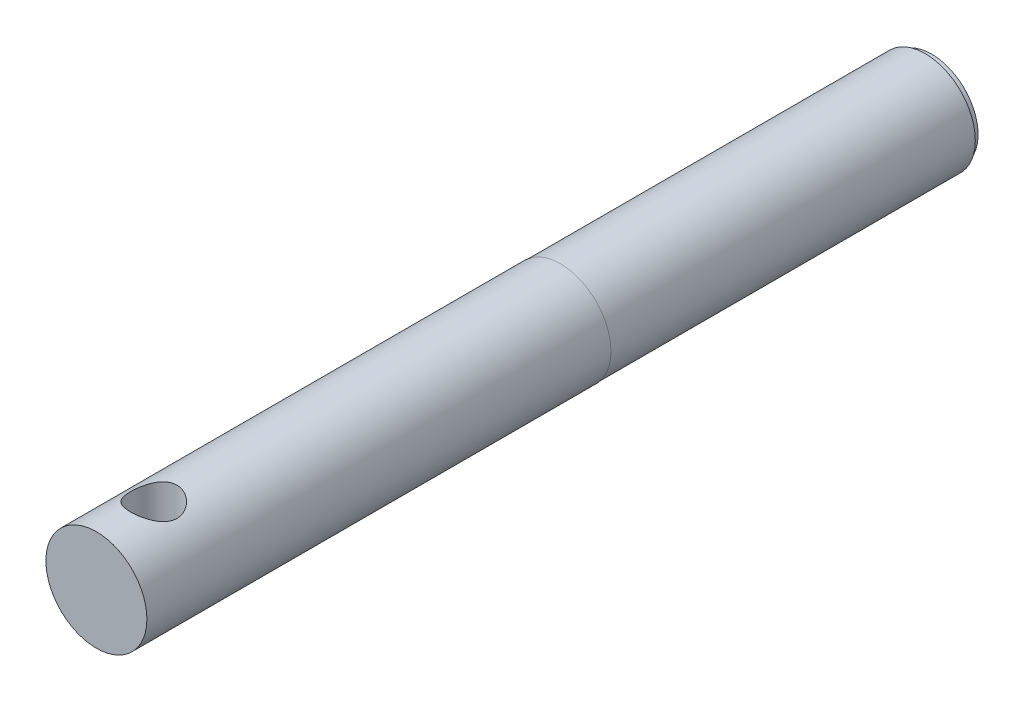
ISO-10303-21;
HEADER;
FILE_DESCRIPTION(('STEP AP214'),'2;1');
FILE_NAME('part.step','',(''),(''),'','','');
FILE_SCHEMA(('AUTOMOTIVE_DESIGN { 1 0 10303 214 1 1 1 1 }'));
ENDSEC;
DATA;
#1=APPLICATION_CONTEXT('core data for automotive mechanical design processes');
#2=APPLICATION_PROTOCOL_DEFINITION('international standard','automotive_design',2000,#1);
#3=PRODUCT_CONTEXT('',#1,'mechanical');
#4=PRODUCT('Part','Part','',(#3));
#5=PRODUCT_RELATED_PRODUCT_CATEGORY('part','',(#4));
#6=PRODUCT_DEFINITION_FORMATION('','',#4);
#7=PRODUCT_DEFINITION_CONTEXT('part definition',#1,'design');
#8=PRODUCT_DEFINITION('design','',#6,#7);
#9=PRODUCT_DEFINITION_SHAPE('','',#8);
#10=(LENGTH_UNIT() NAMED_UNIT(*) SI_UNIT(.MILLI.,.METRE.));
#11=(NAMED_UNIT(*) PLANE_ANGLE_UNIT() SI_UNIT($,.RADIAN.));
#12=(NAMED_UNIT(*) SI_UNIT($,.STERADIAN.) SOLID_ANGLE_UNIT());
#13=UNCERTAINTY_MEASURE_WITH_UNIT(LENGTH_MEASURE(1.E-05),#10,'distance_accuracy_value','');
#14=(GEOMETRIC_REPRESENTATION_CONTEXT(3) GLOBAL_UNCERTAINTY_ASSIGNED_CONTEXT((#13)) GLOBAL_UNIT_ASSIGNED_CONTEXT((#10,
#11,#12)) REPRESENTATION_CONTEXT('',''));
#15=CARTESIAN_POINT('',(0.,0.,0.));
#16=DIRECTION('',(0.,0.,1.));
#17=DIRECTION('',(1.,0.,0.));
#18=AXIS2_PLACEMENT_3D('',#15,#16,#17);
#19=CARTESIAN_POINT('',(0.,0.,4.99999999806278));
#20=DIRECTION('',(0.,0.,-0.999999999999998));
#21=DIRECTION('',(-1.,0.,0.));
#22=AXIS2_PLACEMENT_3D('',#19,#20,#21);
#23=CONICAL_SURFACE('',#22,3.45599999866408,1.02974425744227);
#24=CARTESIAN_POINT('',(-1.70530256582424E-10,0.,7.07657430223207));
#25=VERTEX_POINT('',#24);
#26=VERTEX_LOOP('',#25);
#27=FACE_BOUND('',#26,.T.);
#28=CARTESIAN_POINT('',(0.,0.,5.));
#29=DIRECTION('',(0.,0.,0.999999999999998));
#30=DIRECTION('',(1.,0.,0.));
#31=AXIS2_PLACEMENT_3D('',#28,#29,#30);
#32=CIRCLE('',#31,3.456);
#33=CARTESIAN_POINT('',(3.456,0.,5.));
#34=VERTEX_POINT('',#33);
#35=EDGE_CURVE('E32',#34,#34,#32,.F.);
#36=ORIENTED_EDGE('',*,*,#35,.T.);
#37=EDGE_LOOP('',(#36));
#38=FACE_BOUND('',#37,.T.);
#39=ADVANCED_FACE('F16',(#27,#38),#23,.F.);
#40=CARTESIAN_POINT('',(0.,0.,-5.));
#41=DIRECTION('',(0.,0.,0.999999999999998));
#42=DIRECTION('',(1.,0.,0.));
#43=AXIS2_PLACEMENT_3D('',#40,#41,#42);
#44=CYLINDRICAL_SURFACE('',#43,3.456);
#45=CARTESIAN_POINT('',(0.,0.,-15.));
#46=DIRECTION('',(0.,0.,0.999999999999998));
#47=DIRECTION('',(1.,0.,0.));
#48=AXIS2_PLACEMENT_3D('',#45,#46,#47);
#49=CIRCLE('',#48,3.456);
#50=CARTESIAN_POINT('',(3.456,0.,-15.));
#51=VERTEX_POINT('',#50);
#52=EDGE_CURVE('E19',#51,#51,#49,.T.);
#53=ORIENTED_EDGE('',*,*,#52,.F.);
#54=EDGE_LOOP('',(#53));
#55=FACE_BOUND('',#54,.T.);
#56=ORIENTED_EDGE('',*,*,#35,.F.);
#57=EDGE_LOOP('',(#56));
#58=FACE_BOUND('',#57,.T.);
#59=ADVANCED_FACE('F29',(#55,#58),#44,.F.);
#60=CARTESIAN_POINT('',(0.,0.,-15.));
#61=DIRECTION('',(0.,0.,-0.999999999999998));
#62=DIRECTION('',(-1.,0.,0.));
#63=AXIS2_PLACEMENT_3D('',#60,#61,#62);
#64=PLANE('',#63);
#65=ORIENTED_EDGE('',*,*,#52,.T.);
#66=EDGE_LOOP('',(#65));
#67=FACE_BOUND('',#66,.T.);
#68=CARTESIAN_POINT('',(0.,0.,-15.));
#69=DIRECTION('',(0.,0.,-0.999999999999998));
#70=DIRECTION('',(-1.,0.,0.));
#71=AXIS2_PLACEMENT_3D('',#68,#69,#70);
#72=CIRCLE('',#71,5.);
#73=CARTESIAN_POINT('',(-5.,0.,-15.));
#74=VERTEX_POINT('',#73);
#75=EDGE_CURVE('E36',#74,#74,#72,.F.);
#76=ORIENTED_EDGE('',*,*,#75,.F.);
#77=EDGE_LOOP('',(#76));
#78=FACE_BOUND('',#77,.T.);
#79=ADVANCED_FACE('F74',(#67,#78),#64,.T.);
#80=CARTESIAN_POINT('',(0.,0.,-14.3));
#81=DIRECTION('',(0.,0.,-0.999999999999998));
#82=DIRECTION('',(-1.,0.,0.));
#83=AXIS2_PLACEMENT_3D('',#80,#81,#82);
#84=CYLINDRICAL_SURFACE('',#83,5.);
#85=CARTESIAN_POINT('',(0.,0.,-14.3));
#86=DIRECTION('',(0.,0.,-0.999999999999998));
#87=DIRECTION('',(-1.,0.,0.));
#88=AXIS2_PLACEMENT_3D('',#85,#86,#87);
#89=CIRCLE('',#88,5.);
#90=CARTESIAN_POINT('',(-5.,0.,-14.3));
#91=VERTEX_POINT('',#90);
#92=EDGE_CURVE('E67',#91,#91,#89,.F.);
#93=ORIENTED_EDGE('',*,*,#92,.F.);
#94=EDGE_LOOP('',(#93));
#95=FACE_BOUND('',#94,.T.);
#96=ORIENTED_EDGE('',*,*,#75,.T.);
#97=EDGE_LOOP('',(#96));
#98=FACE_BOUND('',#97,.T.);
#99=ADVANCED_FACE('F72',(#95,#98),#84,.T.);
#100=CARTESIAN_POINT('',(0.,0.,-14.3));
#101=DIRECTION('',(0.,0.,-0.999999999999998));
#102=DIRECTION('',(-1.,0.,0.));
#103=AXIS2_PLACEMENT_3D('',#100,#101,#102);
#104=PLANE('',#103);
#105=ORIENTED_EDGE('',*,*,#92,.T.);
#106=EDGE_LOOP('',(#105));
#107=FACE_BOUND('',#106,.T.);
#108=CARTESIAN_POINT('',(0.,0.,-14.3));
#109=DIRECTION('',(0.,0.,0.999999999999998));
#110=DIRECTION('',(1.,0.,0.));
#111=AXIS2_PLACEMENT_3D('',#108,#109,#110);
#112=CIRCLE('',#111,5.4);
#113=CARTESIAN_POINT('',(5.4,0.,-14.3));
#114=VERTEX_POINT('',#113);
#115=EDGE_CURVE('E64',#114,#114,#112,.T.);
#116=ORIENTED_EDGE('',*,*,#115,.F.);
#117=EDGE_LOOP('',(#116));
#118=FACE_BOUND('',#117,.T.);
#119=ADVANCED_FACE('F83',(#107,#118),#104,.T.);
#120=CARTESIAN_POINT('',(0.,0.,-15.));
#121=DIRECTION('',(0.,0.,0.999999999999998));
#122=DIRECTION('',(1.,0.,0.));
#123=AXIS2_PLACEMENT_3D('',#120,#121,#122);
#124=CYLINDRICAL_SURFACE('',#123,5.4);
#125=CARTESIAN_POINT('',(0.,0.,25.));
#126=DIRECTION('',(0.,0.,0.999999999999998));
#127=DIRECTION('',(1.,0.,0.));
#128=AXIS2_PLACEMENT_3D('',#125,#126,#127);
#129=CIRCLE('',#128,5.4);
#130=CARTESIAN_POINT('',(5.4,0.,25.));
#131=VERTEX_POINT('',#130);
#132=EDGE_CURVE('E61',#131,#131,#129,.F.);
#133=ORIENTED_EDGE('',*,*,#132,.T.);
#134=EDGE_LOOP('',(#133));
#135=FACE_BOUND('',#134,.T.);
#136=ORIENTED_EDGE('',*,*,#115,.T.);
#137=EDGE_LOOP('',(#136));
#138=FACE_BOUND('',#137,.T.);
#139=ADVANCED_FACE('F90',(#135,#138),#124,.T.);
#140=CARTESIAN_POINT('',(0.,0.,74.9999999999992));
#141=DIRECTION('',(0.,0.,0.999999999999998));
#142=DIRECTION('',(1.,0.,0.));
#143=AXIS2_PLACEMENT_3D('',#140,#141,#142);
#144=PLANE('',#143);
#145=CARTESIAN_POINT('',(0.,0.,74.9999999999992));
#146=DIRECTION('',(0.,0.,0.999999999999998));
#147=DIRECTION('',(1.,0.,0.));
#148=AXIS2_PLACEMENT_3D('',#145,#146,#147);
#149=CIRCLE('',#148,5.44);
#150=CARTESIAN_POINT('',(5.44,0.,74.9999999999992));
#151=VERTEX_POINT('',#150);
#152=EDGE_CURVE('E44',#151,#151,#149,.F.);
#153=ORIENTED_EDGE('',*,*,#152,.F.);
#154=EDGE_LOOP('',(#153));
#155=FACE_BOUND('',#154,.T.);
#156=ADVANCED_FACE('F93',(#155),#144,.T.);
#157=CARTESIAN_POINT('',(0.,-5.90000000000007,68.8211407099993));
#158=DIRECTION('',(0.,1.,0.));
#159=DIRECTION('',(-1.,0.,0.));
#160=AXIS2_PLACEMENT_3D('',#157,#158,#159);
#161=CYLINDRICAL_SURFACE('',#160,2.5);
#162=CARTESIAN_POINT('',(0.,5.44,71.3211407099992));
#163=CARTESIAN_POINT('',(-0.132864784388721,5.43999625258356,71.3211363697411));
#164=CARTESIAN_POINT('',(-0.265772460558713,5.43508548541254,71.3105011001088));
#165=CARTESIAN_POINT('',(-0.527598809561394,5.41594958409638,71.2684352664719));
#166=CARTESIAN_POINT('',(-0.65651474883653,5.40171820870862,71.2369907680955));
#167=CARTESIAN_POINT('',(-0.906366772503191,5.36544490053027,71.1547539341593));
#168=CARTESIAN_POINT('',(-1.02732572906732,5.34342662925658,71.104020176896));
#169=CARTESIAN_POINT('',(-1.25891993855526,5.2936538327129,70.984954481027));
#170=CARTESIAN_POINT('',(-1.36955350168622,5.26589837090926,70.9166196687929));
#171=CARTESIAN_POINT('',(-1.58394067505728,5.20555357642165,70.7601282309861));
#172=CARTESIAN_POINT('',(-1.68701423538808,5.17278554406649,70.6711098722153));
#173=CARTESIAN_POINT('',(-1.87738488491151,5.10677957132293,70.4776026292967));
#174=CARTESIAN_POINT('',(-1.96467105470023,5.07354132271067,70.3731031277488));
#175=CARTESIAN_POINT('',(-2.12646669144435,5.00797747373566,70.1436635469521));
#176=CARTESIAN_POINT('',(-2.19982117658896,4.97584206780518,70.0178493681889));
#177=CARTESIAN_POINT('',(-2.32397094045221,4.91909121934583,69.7540576177006));
#178=CARTESIAN_POINT('',(-2.37479784504739,4.89446524977787,69.6160974258993));
#179=CARTESIAN_POINT('',(-2.44184208521945,4.86127705808089,69.368338757913));
#180=CARTESIAN_POINT('',(-2.46358331178065,4.85021848481535,69.2603468233708));
#181=CARTESIAN_POINT('',(-2.49266191791752,4.83533948675679,69.0419597692253));
#182=CARTESIAN_POINT('',(-2.50000402888216,4.83151668438448,68.931565451078));
#183=CARTESIAN_POINT('',(-2.49999518287171,4.83152725665756,68.6891114962585));
#184=CARTESIAN_POINT('',(-2.48948849940832,4.83700488448935,68.5570387906204));
#185=CARTESIAN_POINT('',(-2.44798050288903,4.85813821942767,68.2969534026056));
#186=CARTESIAN_POINT('',(-2.4169618249518,4.87380255012569,68.1689442566362));
#187=CARTESIAN_POINT('',(-2.33596680587854,4.91313106725794,67.9210261032673));
#188=CARTESIAN_POINT('',(-2.28606729657343,4.93676279004502,67.8010865575417));
#189=CARTESIAN_POINT('',(-2.16897647854165,4.98931322017073,67.5712642533904));
#190=CARTESIAN_POINT('',(-2.10178086471887,5.01823324327682,67.4613840080245));
#191=CARTESIAN_POINT('',(-1.94657001809834,5.08054313967583,67.2464582945429));
#192=CARTESIAN_POINT('',(-1.85743925718106,5.11410369823833,67.1422676502364));
#193=CARTESIAN_POINT('',(-1.663209115341,5.18052767184328,66.9496567393891));
#194=CARTESIAN_POINT('',(-1.55810190220851,5.21339073589495,66.8612442543204));
#195=CARTESIAN_POINT('',(-1.32782211599785,5.2768848573598,66.6979624600133));
#196=CARTESIAN_POINT('',(-1.20186258618052,5.30729283952276,66.6241090702312));
#197=CARTESIAN_POINT('',(-0.937706595666798,5.3602581416107,66.4990746675933));
#198=CARTESIAN_POINT('',(-0.799525913760074,5.38282540432907,66.4478649177552));
#199=CARTESIAN_POINT('',(-0.550853005717635,5.41310610695688,66.3800810164308));
#200=CARTESIAN_POINT('',(-0.442104015617571,5.42312503743345,66.3580422765134));
#201=CARTESIAN_POINT('',(-0.222246357668506,5.43657286747313,66.3285718236923));
#202=CARTESIAN_POINT('',(-0.111138184349336,5.44000313462337,66.3211370794781));
#203=CARTESIAN_POINT('',(0.13286478438871,5.43999625258356,66.3211450502574));
#204=CARTESIAN_POINT('',(0.265772460558688,5.43508548541254,66.3317803198897));
#205=CARTESIAN_POINT('',(0.527598809561378,5.41594958409638,66.3738461535267));
#206=CARTESIAN_POINT('',(0.656514748836538,5.40171820870862,66.405290651903));
#207=CARTESIAN_POINT('',(0.906366772503183,5.36544490053028,66.4875274858391));
#208=CARTESIAN_POINT('',(1.02732572906727,5.34342662925659,66.5382612431026));
#209=CARTESIAN_POINT('',(1.25891993855521,5.29365383271291,66.6573269389715));
#210=CARTESIAN_POINT('',(1.36955350168623,5.26589837090925,66.7256617512056));
#211=CARTESIAN_POINT('',(1.58394067505727,5.20555357642166,66.8821531890124));
#212=CARTESIAN_POINT('',(1.68701423538802,5.17278554406651,66.9711715477832));
#213=CARTESIAN_POINT('',(1.87738488491145,5.10677957132296,67.1646787907019));
#214=CARTESIAN_POINT('',(1.96467105470022,5.07354132271067,67.2691782922496));
#215=CARTESIAN_POINT('',(2.12646669144436,5.00797747373566,67.4986178730464));
#216=CARTESIAN_POINT('',(2.19982117658892,4.9758420678052,67.6244320518096));
#217=CARTESIAN_POINT('',(2.32397094045217,4.91909121934585,67.8882238022979));
#218=CARTESIAN_POINT('',(2.37479784504738,4.89446524977787,68.0261839940991));
#219=CARTESIAN_POINT('',(2.44184208521946,4.86127705808089,68.2739426620855));
#220=CARTESIAN_POINT('',(2.46358331178064,4.85021848481536,68.3819345966277));
#221=CARTESIAN_POINT('',(2.49266191791751,4.8353394867568,68.6003216507733));
#222=CARTESIAN_POINT('',(2.50000402888216,4.83151668438448,68.7107159689205));
#223=CARTESIAN_POINT('',(2.49999518287172,4.83152725665756,68.95316992374));
#224=CARTESIAN_POINT('',(2.48948849940833,4.83700488448935,69.0852426293782));
#225=CARTESIAN_POINT('',(2.44798050288903,4.85813821942767,69.3453280173929));
#226=CARTESIAN_POINT('',(2.41696182495178,4.87380255012569,69.4733371633622));
#227=CARTESIAN_POINT('',(2.33596680587855,4.91313106725793,69.7212553167312));
#228=CARTESIAN_POINT('',(2.28606729657347,4.936762790045,69.8411948624568));
#229=CARTESIAN_POINT('',(2.16897647854168,4.98931322017071,70.0710171666081));
#230=CARTESIAN_POINT('',(2.10178086471887,5.01823324327682,70.1808974119739));
#231=CARTESIAN_POINT('',(1.94657001809834,5.08054313967583,70.3958231254556));
#232=CARTESIAN_POINT('',(1.85743925718111,5.11410369823832,70.5000137697621));
#233=CARTESIAN_POINT('',(1.66320911534103,5.18052767184327,70.6926246806094));
#234=CARTESIAN_POINT('',(1.55810190220848,5.21339073589495,70.7810371656781));
#235=CARTESIAN_POINT('',(1.32782211599778,5.27688485735981,70.9443189599851));
#236=CARTESIAN_POINT('',(1.20186258618048,5.30729283952277,71.0181723497674));
#237=CARTESIAN_POINT('',(0.937706595666777,5.3602581416107,71.1432067524053));
#238=CARTESIAN_POINT('',(0.799525913760028,5.38282540432907,71.1944165022434));
#239=CARTESIAN_POINT('',(0.550853005717587,5.41310610695688,71.2622004035678));
#240=CARTESIAN_POINT('',(0.44210401561754,5.42312503743345,71.2842391434852));
#241=CARTESIAN_POINT('',(0.222246357668497,5.43657286747313,71.3137095963063));
#242=CARTESIAN_POINT('',(0.111138184349332,5.44000313462337,71.3211443405204));
#243=CARTESIAN_POINT('',(0.,5.44,71.3211407099992));
#244=B_SPLINE_CURVE_WITH_KNOTS('',3,(#162,#163,#164,#165,#166,#167,#168,#169,#170,#171,#172,
#173,#174,#175,#176,#177,#178,#179,#180,#181,#182,#183,#184,#185,#186,#187,#188,#189,#190,#191,
#192,#193,#194,#195,#196,#197,#198,#199,#200,#201,#202,#203,#204,#205,#206,#207,#208,#209,#210,
#211,#212,#213,#214,#215,#216,#217,#218,#219,#220,#221,#222,#223,#224,#225,#226,#227,#228,#229,
#230,#231,#232,#233,#234,#235,#236,#237,#238,#239,#240,#241,#242,#243),.UNSPECIFIED.,.T.,.F.,(4,
2,2,2,2,2,2,2,2,2,2,2,2,2,2,2,2,2,2,2,2,2,2,2,2,2,2,2,2,2,2,2,2,2,2,2,2,2,2,2,4),(0.,
0.398167111224074,0.796601115097105,1.19383468209257,1.5911331444081,2.00958740996627,
2.42833000323913,2.87351693981385,3.3180768951139,3.64909606564562,3.98000644872984,
4.37565906489604,4.77164705904969,5.16604069200069,5.5605325867966,5.98220661332002,
6.40408802975552,6.84923810326881,7.29382160511412,7.62694793400188,7.96000510948036,
8.35817222070443,8.75660622457745,9.15383979157291,9.55113825388844,9.96959251944657,
10.3883351127194,10.8335220492942,11.2780820045942,11.609101175126,11.9400115582103,
12.3356641743764,12.73165216853,13.126045801481,13.5205376962769,13.9422117228004,
14.3640931392359,14.8092432127492,15.2538267145945,15.5869530434823,15.9200102189607),.UNSPECIFIED.);
#245=CARTESIAN_POINT('',(0.,5.44,71.3211407099992));
#246=VERTEX_POINT('',#245);
#247=EDGE_CURVE('E23',#246,#246,#244,.T.);
#248=ORIENTED_EDGE('',*,*,#247,.F.);
#249=EDGE_LOOP('',(#248));
#250=FACE_BOUND('',#249,.T.);
#251=CARTESIAN_POINT('',(0.,-5.44,66.3211407099992));
#252=CARTESIAN_POINT('',(-0.13286478438871,-5.43999625258356,66.3211450502574));
#253=CARTESIAN_POINT('',(-0.265772460558687,-5.43508548541254,66.3317803198897));
#254=CARTESIAN_POINT('',(-0.527598809561377,-5.41594958409638,66.3738461535267));
#255=CARTESIAN_POINT('',(-0.656514748836538,-5.40171820870862,66.405290651903));
#256=CARTESIAN_POINT('',(-0.906366772503184,-5.36544490053028,66.4875274858391));
#257=CARTESIAN_POINT('',(-1.02732572906727,-5.34342662925659,66.5382612431026));
#258=CARTESIAN_POINT('',(-1.25891993855521,-5.29365383271291,66.6573269389715));
#259=CARTESIAN_POINT('',(-1.36955350168623,-5.26589837090925,66.7256617512056));
#260=CARTESIAN_POINT('',(-1.58394067505727,-5.20555357642166,66.8821531890124));
#261=CARTESIAN_POINT('',(-1.68701423538802,-5.17278554406651,66.9711715477832));
#262=CARTESIAN_POINT('',(-1.87738488491145,-5.10677957132296,67.1646787907019));
#263=CARTESIAN_POINT('',(-1.96467105470022,-5.07354132271067,67.2691782922496));
#264=CARTESIAN_POINT('',(-2.12646669144436,-5.00797747373566,67.4986178730464));
#265=CARTESIAN_POINT('',(-2.19982117658892,-4.9758420678052,67.6244320518096));
#266=CARTESIAN_POINT('',(-2.32397094045217,-4.91909121934585,67.8882238022979));
#267=CARTESIAN_POINT('',(-2.37479784504738,-4.89446524977787,68.0261839940991));
#268=CARTESIAN_POINT('',(-2.44184208521946,-4.86127705808089,68.2739426620855));
#269=CARTESIAN_POINT('',(-2.46358331178064,-4.85021848481535,68.3819345966277));
#270=CARTESIAN_POINT('',(-2.49266191791751,-4.8353394867568,68.6003216507733));
#271=CARTESIAN_POINT('',(-2.50000402888216,-4.83151668438448,68.7107159689205));
#272=CARTESIAN_POINT('',(-2.49999518287172,-4.83152725665756,68.95316992374));
#273=CARTESIAN_POINT('',(-2.48948849940833,-4.83700488448935,69.0852426293782));
#274=CARTESIAN_POINT('',(-2.44798050288903,-4.85813821942767,69.3453280173929));
#275=CARTESIAN_POINT('',(-2.41696182495178,-4.87380255012569,69.4733371633622));
#276=CARTESIAN_POINT('',(-2.33596680587855,-4.91313106725793,69.7212553167312));
#277=CARTESIAN_POINT('',(-2.28606729657347,-4.936762790045,69.8411948624568));
#278=CARTESIAN_POINT('',(-2.16897647854168,-4.98931322017071,70.0710171666081));
#279=CARTESIAN_POINT('',(-2.10178086471887,-5.01823324327682,70.1808974119739));
#280=CARTESIAN_POINT('',(-1.94657001809834,-5.08054313967583,70.3958231254556));
#281=CARTESIAN_POINT('',(-1.85743925718112,-5.11410369823831,70.5000137697621));
#282=CARTESIAN_POINT('',(-1.66320911534106,-5.18052767184327,70.6926246806094));
#283=CARTESIAN_POINT('',(-1.55810190220852,-5.21339073589495,70.7810371656781));
#284=CARTESIAN_POINT('',(-1.32782211599783,-5.27688485735981,70.9443189599851));
#285=CARTESIAN_POINT('',(-1.20186258618052,-5.30729283952276,71.0181723497674));
#286=CARTESIAN_POINT('',(-0.93770659566679,-5.36025814161069,71.1432067524053));
#287=CARTESIAN_POINT('',(-0.799525913760035,-5.38282540432907,71.1944165022434));
#288=CARTESIAN_POINT('',(-0.550853005717587,-5.41310610695688,71.2622004035678));
#289=CARTESIAN_POINT('',(-0.442104015617538,-5.42312503743345,71.2842391434852));
#290=CARTESIAN_POINT('',(-0.222246357668495,-5.43657286747313,71.3137095963063));
#291=CARTESIAN_POINT('',(-0.111138184349331,-5.44000313462337,71.3211443405204));
#292=CARTESIAN_POINT('',(0.132864784388721,-5.43999625258356,71.3211363697411));
#293=CARTESIAN_POINT('',(0.265772460558713,-5.43508548541254,71.3105011001088));
#294=CARTESIAN_POINT('',(0.527598809561393,-5.41594958409638,71.2684352664719));
#295=CARTESIAN_POINT('',(0.65651474883653,-5.40171820870862,71.2369907680955));
#296=CARTESIAN_POINT('',(0.906366772503191,-5.36544490053027,71.1547539341593));
#297=CARTESIAN_POINT('',(1.02732572906732,-5.34342662925658,71.104020176896));
#298=CARTESIAN_POINT('',(1.25891993855526,-5.2936538327129,70.984954481027));
#299=CARTESIAN_POINT('',(1.36955350168622,-5.26589837090926,70.9166196687929));
#300=CARTESIAN_POINT('',(1.58394067505728,-5.20555357642165,70.7601282309861));
#301=CARTESIAN_POINT('',(1.68701423538808,-5.17278554406649,70.6711098722153));
#302=CARTESIAN_POINT('',(1.87738488491151,-5.10677957132294,70.4776026292967));
#303=CARTESIAN_POINT('',(1.96467105470023,-5.07354132271067,70.3731031277488));
#304=CARTESIAN_POINT('',(2.12646669144435,-5.00797747373566,70.1436635469521));
#305=CARTESIAN_POINT('',(2.19982117658896,-4.97584206780518,70.0178493681889));
#306=CARTESIAN_POINT('',(2.32397094045221,-4.91909121934583,69.7540576177006));
#307=CARTESIAN_POINT('',(2.37479784504739,-4.89446524977787,69.6160974258993));
#308=CARTESIAN_POINT('',(2.44184208521945,-4.86127705808089,69.368338757913));
#309=CARTESIAN_POINT('',(2.46358331178065,-4.85021848481535,69.2603468233708));
#310=CARTESIAN_POINT('',(2.49266191791752,-4.8353394867568,69.0419597692253));
#311=CARTESIAN_POINT('',(2.50000402888216,-4.83151668438448,68.931565451078));
#312=CARTESIAN_POINT('',(2.49999518287171,-4.83152725665756,68.6891114962585));
#313=CARTESIAN_POINT('',(2.48948849940832,-4.83700488448935,68.5570387906204));
#314=CARTESIAN_POINT('',(2.44798050288902,-4.85813821942767,68.2969534026056));
#315=CARTESIAN_POINT('',(2.4169618249518,-4.87380255012569,68.1689442566362));
#316=CARTESIAN_POINT('',(2.33596680587854,-4.91313106725794,67.9210261032673));
#317=CARTESIAN_POINT('',(2.28606729657343,-4.93676279004502,67.8010865575417));
#318=CARTESIAN_POINT('',(2.16897647854165,-4.98931322017073,67.5712642533904));
#319=CARTESIAN_POINT('',(2.10178086471887,-5.01823324327682,67.4613840080245));
#320=CARTESIAN_POINT('',(1.94657001809834,-5.08054313967583,67.2464582945429));
#321=CARTESIAN_POINT('',(1.85743925718106,-5.11410369823833,67.1422676502364));
#322=CARTESIAN_POINT('',(1.663209115341,-5.18052767184328,66.9496567393891));
#323=CARTESIAN_POINT('',(1.55810190220851,-5.21339073589495,66.8612442543204));
#324=CARTESIAN_POINT('',(1.32782211599785,-5.27688485735981,66.6979624600133));
#325=CARTESIAN_POINT('',(1.20186258618051,-5.30729283952276,66.6241090702312));
#326=CARTESIAN_POINT('',(0.937706595666767,-5.3602581416107,66.4990746675932));
#327=CARTESIAN_POINT('',(0.799525913760028,-5.38282540432907,66.4478649177552));
#328=CARTESIAN_POINT('',(0.550853005717586,-5.41310610695688,66.3800810164308));
#329=CARTESIAN_POINT('',(0.442104015617531,-5.42312503743345,66.3580422765134));
#330=CARTESIAN_POINT('',(0.222246357668486,-5.43657286747313,66.3285718236923));
#331=CARTESIAN_POINT('',(0.111138184349325,-5.44000313462337,66.3211370794781));
#332=CARTESIAN_POINT('',(0.,-5.44,66.3211407099992));
#333=B_SPLINE_CURVE_WITH_KNOTS('',3,(#251,#252,#253,#254,#255,#256,#257,#258,#259,#260,#261,
#262,#263,#264,#265,#266,#267,#268,#269,#270,#271,#272,#273,#274,#275,#276,#277,#278,#279,#280,
#281,#282,#283,#284,#285,#286,#287,#288,#289,#290,#291,#292,#293,#294,#295,#296,#297,#298,#299,
#300,#301,#302,#303,#304,#305,#306,#307,#308,#309,#310,#311,#312,#313,#314,#315,#316,#317,#318,
#319,#320,#321,#322,#323,#324,#325,#326,#327,#328,#329,#330,#331,#332),.UNSPECIFIED.,.T.,.F.,(4,
2,2,2,2,2,2,2,2,2,2,2,2,2,2,2,2,2,2,2,2,2,2,2,2,2,2,2,2,2,2,2,2,2,2,2,2,2,2,2,4),(0.,
0.39816711122406,0.796601115097087,1.19383468209255,1.59113314440807,2.00958740996621,
2.42833000323908,2.8735169398138,3.31807689511384,3.64909606564562,3.98000644872989,
4.37565906489604,4.77164705904964,5.16604069200063,5.56053258679655,5.98220661331997,
6.40408802975549,6.84923810326884,7.29382160511419,7.62694793400192,7.96000510948038,
8.35817222070445,8.75660622457748,9.15383979157295,9.55113825388848,9.96959251944664,
10.3883351127195,10.8335220492942,11.2780820045943,11.609101175126,11.9400115582102,
12.3356641743764,12.7316521685301,13.1260458014811,13.520537696277,13.9422117228004,
14.3640931392359,14.8092432127492,15.2538267145945,15.5869530434823,15.9200102189607),.UNSPECIFIED.);
#334=CARTESIAN_POINT('',(0.,-5.44,66.3211407099992));
#335=VERTEX_POINT('',#334);
#336=EDGE_CURVE('E56',#335,#335,#333,.T.);
#337=ORIENTED_EDGE('',*,*,#336,.F.);
#338=EDGE_LOOP('',(#337));
#339=FACE_BOUND('',#338,.T.);
#340=ADVANCED_FACE('F46',(#250,#339),#161,.F.);
#341=CARTESIAN_POINT('',(0.,0.,25.));
#342=DIRECTION('',(0.,0.,0.999999999999998));
#343=DIRECTION('',(1.,0.,0.));
#344=AXIS2_PLACEMENT_3D('',#341,#342,#343);
#345=PLANE('',#344);
#346=ORIENTED_EDGE('',*,*,#132,.F.);
#347=EDGE_LOOP('',(#346));
#348=FACE_BOUND('',#347,.T.);
#349=CARTESIAN_POINT('',(0.,0.,25.));
#350=DIRECTION('',(0.,0.,0.999999999999998));
#351=DIRECTION('',(1.,0.,0.));
#352=AXIS2_PLACEMENT_3D('',#349,#350,#351);
#353=CIRCLE('',#352,5.44);
#354=CARTESIAN_POINT('',(5.44,0.,25.));
#355=VERTEX_POINT('',#354);
#356=EDGE_CURVE('E11',#355,#355,#353,.T.);
#357=ORIENTED_EDGE('',*,*,#356,.F.);
#358=EDGE_LOOP('',(#357));
#359=FACE_BOUND('',#358,.T.);
#360=ADVANCED_FACE('F53',(#348,#359),#345,.F.);
#361=CARTESIAN_POINT('',(0.,0.,25.));
#362=DIRECTION('',(0.,0.,0.999999999999998));
#363=DIRECTION('',(1.,0.,0.));
#364=AXIS2_PLACEMENT_3D('',#361,#362,#363);
#365=CYLINDRICAL_SURFACE('',#364,5.44);
#366=ORIENTED_EDGE('',*,*,#336,.T.);
#367=EDGE_LOOP('',(#366));
#368=FACE_BOUND('',#367,.T.);
#369=ORIENTED_EDGE('',*,*,#152,.T.);
#370=EDGE_LOOP('',(#369));
#371=FACE_BOUND('',#370,.T.);
#372=ORIENTED_EDGE('',*,*,#247,.T.);
#373=EDGE_LOOP('',(#372));
#374=FACE_BOUND('',#373,.T.);
#375=ORIENTED_EDGE('',*,*,#356,.T.);
#376=EDGE_LOOP('',(#375));
#377=FACE_BOUND('',#376,.T.);
#378=ADVANCED_FACE('F50',(#368,#371,#374,#377),#365,.T.);
#379=CLOSED_SHELL('',(#39,#59,#79,#99,#119,#139,#156,#340,#360,#378));
#380=MANIFOLD_SOLID_BREP('B1',#379);
#381=ADVANCED_BREP_SHAPE_REPRESENTATION('',(#18,#380),#14);
#382=SHAPE_DEFINITION_REPRESENTATION(#9,#381);
ENDSEC;
END-ISO-10303-21;
